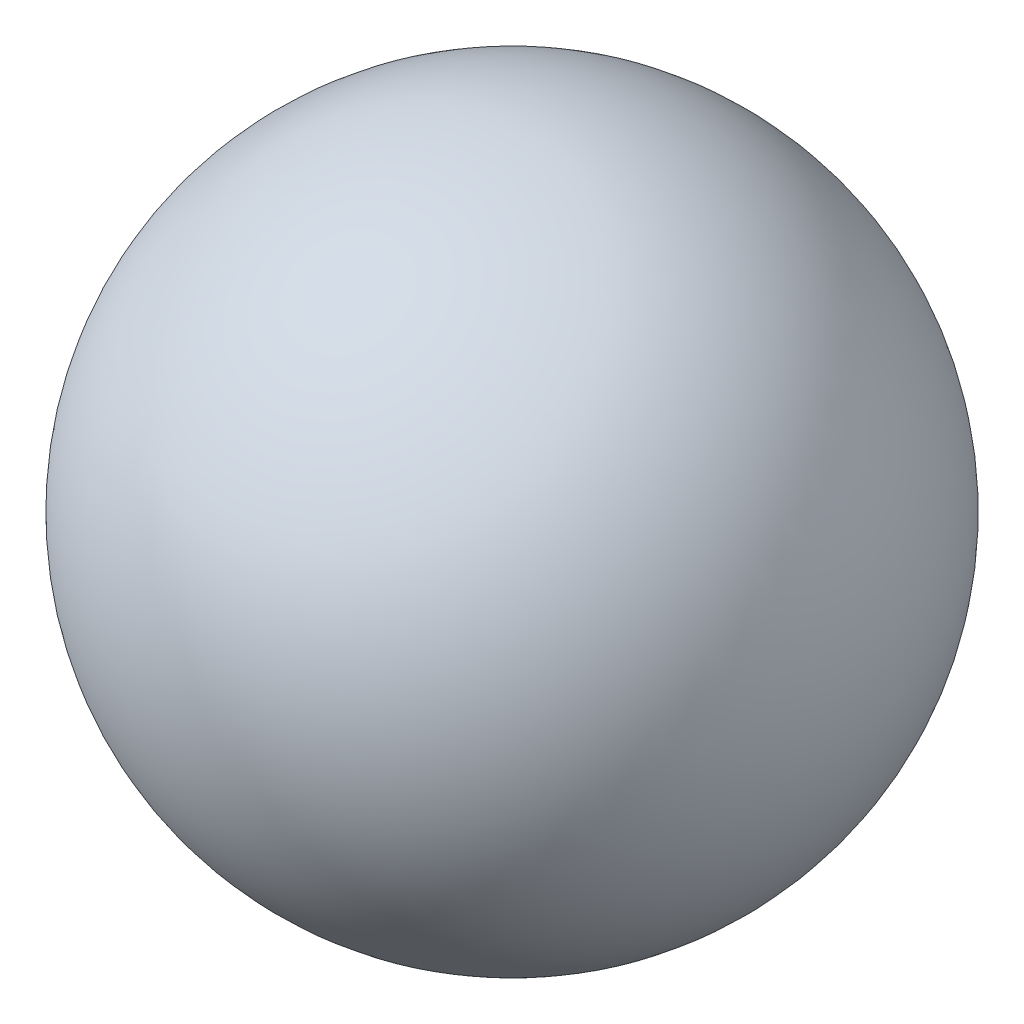
ISO-10303-21;
HEADER;
FILE_DESCRIPTION(('STEP AP214'),'2;1');
FILE_NAME('part.step','',(''),(''),'','','');
FILE_SCHEMA(('AUTOMOTIVE_DESIGN { 1 0 10303 214 1 1 1 1 }'));
ENDSEC;
DATA;
#1=APPLICATION_CONTEXT('core data for automotive mechanical design processes');
#2=APPLICATION_PROTOCOL_DEFINITION('international standard','automotive_design',2000,#1);
#3=PRODUCT_CONTEXT('',#1,'mechanical');
#4=PRODUCT('Part','Part','',(#3));
#5=PRODUCT_RELATED_PRODUCT_CATEGORY('part','',(#4));
#6=PRODUCT_DEFINITION_FORMATION('','',#4);
#7=PRODUCT_DEFINITION_CONTEXT('part definition',#1,'design');
#8=PRODUCT_DEFINITION('design','',#6,#7);
#9=PRODUCT_DEFINITION_SHAPE('','',#8);
#10=(LENGTH_UNIT() NAMED_UNIT(*) SI_UNIT(.MILLI.,.METRE.));
#11=(NAMED_UNIT(*) PLANE_ANGLE_UNIT() SI_UNIT($,.RADIAN.));
#12=(NAMED_UNIT(*) SI_UNIT($,.STERADIAN.) SOLID_ANGLE_UNIT());
#13=UNCERTAINTY_MEASURE_WITH_UNIT(LENGTH_MEASURE(1.E-05),#10,'distance_accuracy_value','');
#14=(GEOMETRIC_REPRESENTATION_CONTEXT(3) GLOBAL_UNCERTAINTY_ASSIGNED_CONTEXT((#13)) GLOBAL_UNIT_ASSIGNED_CONTEXT((#10,
#11,#12)) REPRESENTATION_CONTEXT('',''));
#15=CARTESIAN_POINT('',(0.,0.,0.));
#16=DIRECTION('',(0.,0.,1.));
#17=DIRECTION('',(1.,0.,0.));
#18=AXIS2_PLACEMENT_3D('',#15,#16,#17);
#19=CARTESIAN_POINT('',(0.,0.,0.));
#20=DIRECTION('',(0.,1.,0.));
#21=DIRECTION('',(1.,0.,0.));
#22=AXIS2_PLACEMENT_3D('',#19,#20,#21);
#23=SPHERICAL_SURFACE('',#22,31.5);
#24=CARTESIAN_POINT('',(0.,31.5,0.));
#25=VERTEX_POINT('',#24);
#26=VERTEX_LOOP('',#25);
#27=FACE_BOUND('',#26,.T.);
#28=ADVANCED_FACE('F33',(#27),#23,.T.);
#29=CLOSED_SHELL('',(#28));
#30=MANIFOLD_SOLID_BREP('B2',#29);
#31=ADVANCED_BREP_SHAPE_REPRESENTATION('',(#18,#30),#14);
#32=SHAPE_DEFINITION_REPRESENTATION(#9,#31);
ENDSEC;
END-ISO-10303-21;
